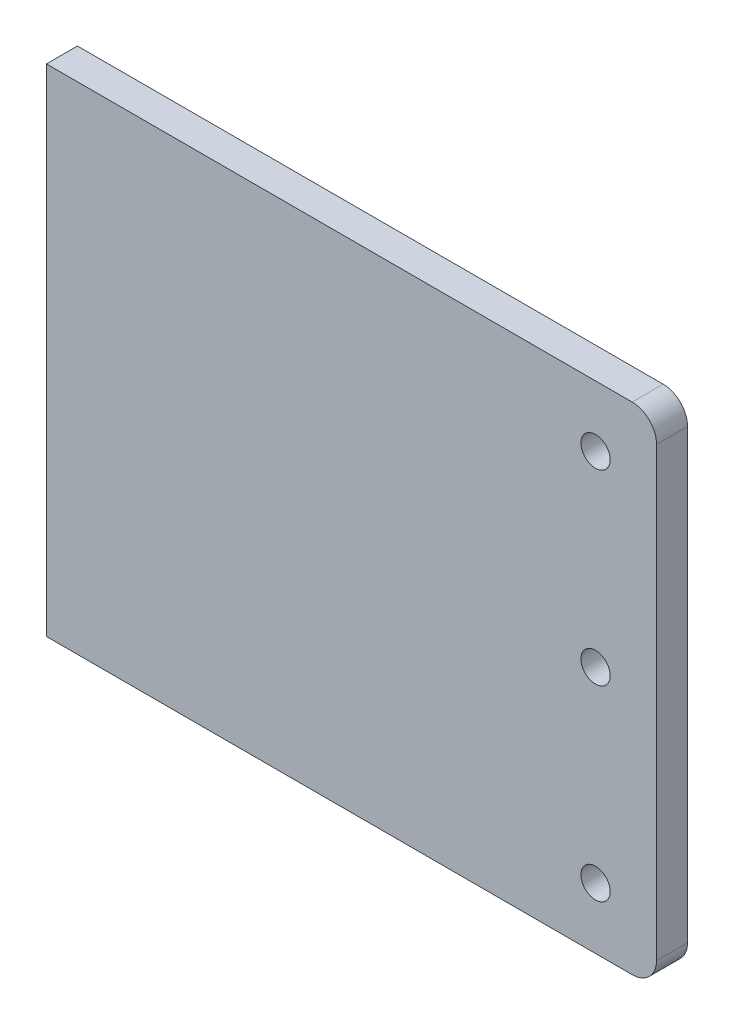
ISO-10303-21;
HEADER;
FILE_DESCRIPTION(('STEP AP214'),'2;1');
FILE_NAME('part.step','',(''),(''),'','','');
FILE_SCHEMA(('AUTOMOTIVE_DESIGN { 1 0 10303 214 1 1 1 1 }'));
ENDSEC;
DATA;
#1=APPLICATION_CONTEXT('core data for automotive mechanical design processes');
#2=APPLICATION_PROTOCOL_DEFINITION('international standard','automotive_design',2000,#1);
#3=PRODUCT_CONTEXT('',#1,'mechanical');
#4=PRODUCT('Part','Part','',(#3));
#5=PRODUCT_RELATED_PRODUCT_CATEGORY('part','',(#4));
#6=PRODUCT_DEFINITION_FORMATION('','',#4);
#7=PRODUCT_DEFINITION_CONTEXT('part definition',#1,'design');
#8=PRODUCT_DEFINITION('design','',#6,#7);
#9=PRODUCT_DEFINITION_SHAPE('','',#8);
#10=(LENGTH_UNIT() NAMED_UNIT(*) SI_UNIT(.MILLI.,.METRE.));
#11=(NAMED_UNIT(*) PLANE_ANGLE_UNIT() SI_UNIT($,.RADIAN.));
#12=(NAMED_UNIT(*) SI_UNIT($,.STERADIAN.) SOLID_ANGLE_UNIT());
#13=UNCERTAINTY_MEASURE_WITH_UNIT(LENGTH_MEASURE(1.E-05),#10,'distance_accuracy_value','');
#14=(GEOMETRIC_REPRESENTATION_CONTEXT(3) GLOBAL_UNCERTAINTY_ASSIGNED_CONTEXT((#13)) GLOBAL_UNIT_ASSIGNED_CONTEXT((#10,
#11,#12)) REPRESENTATION_CONTEXT('',''));
#15=CARTESIAN_POINT('',(0.,0.,0.));
#16=DIRECTION('',(0.,0.,1.));
#17=DIRECTION('',(1.,0.,0.));
#18=AXIS2_PLACEMENT_3D('',#15,#16,#17);
#19=CARTESIAN_POINT('',(-50.01,203.6,-127.004202423773));
#20=DIRECTION('',(0.,0.,-1.));
#21=DIRECTION('',(-1.,0.,0.));
#22=AXIS2_PLACEMENT_3D('',#19,#20,#21);
#23=PLANE('',#22);
#24=DIRECTION('',(1.,0.,0.));
#25=VECTOR('',#24,1.);
#26=CARTESIAN_POINT('',(-50.01,102.,-127.004202423773));
#27=LINE('',#26,#25);
#28=CARTESIAN_POINT('',(-50.,102.,-127.004202423773));
#29=VERTEX_POINT('',#28);
#30=CARTESIAN_POINT('',(70.,102.,-127.004202423773));
#31=VERTEX_POINT('',#30);
#32=EDGE_CURVE('E11',#29,#31,#27,.T.);
#33=ORIENTED_EDGE('',*,*,#32,.F.);
#34=DIRECTION('',(0.,-1.,0.));
#35=VECTOR('',#34,1.);
#36=CARTESIAN_POINT('',(-50.,0.,-127.004202423773));
#37=LINE('',#36,#35);
#38=CARTESIAN_POINT('',(-50.,203.6,-127.004202423773));
#39=VERTEX_POINT('',#38);
#40=EDGE_CURVE('E40',#39,#29,#37,.T.);
#41=ORIENTED_EDGE('',*,*,#40,.F.);
#42=DIRECTION('',(-1.,0.,0.));
#43=VECTOR('',#42,1.);
#44=CARTESIAN_POINT('',(50.,203.6,-127.004202423773));
#45=LINE('',#44,#43);
#46=CARTESIAN_POINT('',(70.,203.6,-127.004202423773));
#47=VERTEX_POINT('',#46);
#48=EDGE_CURVE('E95',#47,#39,#45,.T.);
#49=ORIENTED_EDGE('',*,*,#48,.F.);
#50=CARTESIAN_POINT('',(70.,198.6,-127.004202423773));
#51=DIRECTION('',(0.,0.,1.));
#52=DIRECTION('',(0.,-1.,0.));
#53=AXIS2_PLACEMENT_3D('',#50,#51,#52);
#54=CIRCLE('',#53,5.);
#55=CARTESIAN_POINT('',(75.,198.6,-127.004202423773));
#56=VERTEX_POINT('',#55);
#57=EDGE_CURVE('E131',#47,#56,#54,.F.);
#58=ORIENTED_EDGE('',*,*,#57,.T.);
#59=DIRECTION('',(0.,1.,0.));
#60=VECTOR('',#59,1.);
#61=CARTESIAN_POINT('',(75.,203.6,-127.004202423773));
#62=LINE('',#61,#60);
#63=CARTESIAN_POINT('',(75.,107.,-127.004202423773));
#64=VERTEX_POINT('',#63);
#65=EDGE_CURVE('E96',#64,#56,#62,.T.);
#66=ORIENTED_EDGE('',*,*,#65,.F.);
#67=CARTESIAN_POINT('',(70.,107.,-127.004202423773));
#68=DIRECTION('',(0.,0.,1.));
#69=DIRECTION('',(0.,-1.,0.));
#70=AXIS2_PLACEMENT_3D('',#67,#68,#69);
#71=CIRCLE('',#70,5.);
#72=EDGE_CURVE('E128',#64,#31,#71,.F.);
#73=ORIENTED_EDGE('',*,*,#72,.T.);
#74=EDGE_LOOP('',(#33,#41,#49,#58,#66,#73));
#75=FACE_BOUND('',#74,.T.);
#76=CARTESIAN_POINT('',(62.5,114.5,-127.004202423773));
#77=DIRECTION('',(0.,0.,1.));
#78=DIRECTION('',(0.,-1.,0.));
#79=AXIS2_PLACEMENT_3D('',#76,#77,#78);
#80=CIRCLE('',#79,3.00000000000001);
#81=CARTESIAN_POINT('',(62.5,111.5,-127.004202423773));
#82=VERTEX_POINT('',#81);
#83=EDGE_CURVE('E111',#82,#82,#80,.T.);
#84=ORIENTED_EDGE('',*,*,#83,.T.);
#85=EDGE_LOOP('',(#84));
#86=FACE_BOUND('',#85,.T.);
#87=CARTESIAN_POINT('',(62.5,191.1,-127.004202423773));
#88=DIRECTION('',(0.,0.,1.));
#89=DIRECTION('',(0.,-1.,0.));
#90=AXIS2_PLACEMENT_3D('',#87,#88,#89);
#91=CIRCLE('',#90,3.00000000000001);
#92=CARTESIAN_POINT('',(62.5,188.1,-127.004202423773));
#93=VERTEX_POINT('',#92);
#94=EDGE_CURVE('E116',#93,#93,#91,.T.);
#95=ORIENTED_EDGE('',*,*,#94,.T.);
#96=EDGE_LOOP('',(#95));
#97=FACE_BOUND('',#96,.T.);
#98=CARTESIAN_POINT('',(62.5,152.8,-127.004202423773));
#99=DIRECTION('',(0.,0.,1.));
#100=DIRECTION('',(0.,-1.,0.));
#101=AXIS2_PLACEMENT_3D('',#98,#99,#100);
#102=CIRCLE('',#101,3.00000000000001);
#103=CARTESIAN_POINT('',(62.5,149.8,-127.004202423773));
#104=VERTEX_POINT('',#103);
#105=EDGE_CURVE('E108',#104,#104,#102,.T.);
#106=ORIENTED_EDGE('',*,*,#105,.T.);
#107=EDGE_LOOP('',(#106));
#108=FACE_BOUND('',#107,.T.);
#109=ADVANCED_FACE('F36',(#75,#86,#97,#108),#23,.T.);
#110=CARTESIAN_POINT('',(-50.01,102.,-38.1042024237733));
#111=DIRECTION('',(0.,-1.,0.));
#112=DIRECTION('',(0.,0.,-1.));
#113=AXIS2_PLACEMENT_3D('',#110,#111,#112);
#114=PLANE('',#113);
#115=DIRECTION('',(0.,0.,1.));
#116=VECTOR('',#115,1.);
#117=CARTESIAN_POINT('',(-50.,102.,0.));
#118=LINE('',#117,#116);
#119=CARTESIAN_POINT('',(-50.,102.,-120.654202423773));
#120=VERTEX_POINT('',#119);
#121=EDGE_CURVE('E93',#29,#120,#118,.T.);
#122=ORIENTED_EDGE('',*,*,#121,.F.);
#123=ORIENTED_EDGE('',*,*,#32,.T.);
#124=DIRECTION('',(0.,0.,-1.));
#125=VECTOR('',#124,1.);
#126=CARTESIAN_POINT('',(70.,102.,-120.654202423773));
#127=LINE('',#126,#125);
#128=CARTESIAN_POINT('',(70.,102.,-120.654202423773));
#129=VERTEX_POINT('',#128);
#130=EDGE_CURVE('E60',#31,#129,#127,.F.);
#131=ORIENTED_EDGE('',*,*,#130,.T.);
#132=DIRECTION('',(-1.,0.,0.));
#133=VECTOR('',#132,1.);
#134=CARTESIAN_POINT('',(75.,102.,-120.654202423773));
#135=LINE('',#134,#133);
#136=EDGE_CURVE('E89',#129,#120,#135,.T.);
#137=ORIENTED_EDGE('',*,*,#136,.T.);
#138=EDGE_LOOP('',(#122,#123,#131,#137));
#139=FACE_BOUND('',#138,.T.);
#140=ADVANCED_FACE('F91',(#139),#114,.T.);
#141=CARTESIAN_POINT('',(-50.,0.,0.));
#142=DIRECTION('',(-1.,0.,0.));
#143=DIRECTION('',(0.,0.,1.));
#144=AXIS2_PLACEMENT_3D('',#141,#142,#143);
#145=PLANE('',#144);
#146=ORIENTED_EDGE('',*,*,#40,.T.);
#147=ORIENTED_EDGE('',*,*,#121,.T.);
#148=DIRECTION('',(0.,-1.,0.));
#149=VECTOR('',#148,1.);
#150=CARTESIAN_POINT('',(-50.,102.,-120.654202423773));
#151=LINE('',#150,#149);
#152=CARTESIAN_POINT('',(-50.,203.6,-120.654202423773));
#153=VERTEX_POINT('',#152);
#154=EDGE_CURVE('E99',#153,#120,#151,.T.);
#155=ORIENTED_EDGE('',*,*,#154,.F.);
#156=DIRECTION('',(0.,0.,1.));
#157=VECTOR('',#156,1.);
#158=CARTESIAN_POINT('',(-50.,203.6,-120.654202423773));
#159=LINE('',#158,#157);
#160=EDGE_CURVE('E104',#39,#153,#159,.T.);
#161=ORIENTED_EDGE('',*,*,#160,.F.);
#162=EDGE_LOOP('',(#146,#147,#155,#161));
#163=FACE_BOUND('',#162,.T.);
#164=ADVANCED_FACE('F38',(#163),#145,.T.);
#165=CARTESIAN_POINT('',(75.,0.,0.));
#166=DIRECTION('',(1.,0.,0.));
#167=DIRECTION('',(0.,0.,-1.));
#168=AXIS2_PLACEMENT_3D('',#165,#166,#167);
#169=PLANE('',#168);
#170=DIRECTION('',(0.,-1.,0.));
#171=VECTOR('',#170,1.);
#172=CARTESIAN_POINT('',(75.,203.6,-120.654202423773));
#173=LINE('',#172,#171);
#174=CARTESIAN_POINT('',(75.,198.6,-120.654202423773));
#175=VERTEX_POINT('',#174);
#176=CARTESIAN_POINT('',(75.,107.,-120.654202423773));
#177=VERTEX_POINT('',#176);
#178=EDGE_CURVE('E143',#175,#177,#173,.T.);
#179=ORIENTED_EDGE('',*,*,#178,.T.);
#180=DIRECTION('',(0.,0.,-1.));
#181=VECTOR('',#180,1.);
#182=CARTESIAN_POINT('',(75.,107.,-127.004202423773));
#183=LINE('',#182,#181);
#184=EDGE_CURVE('E133',#177,#64,#183,.T.);
#185=ORIENTED_EDGE('',*,*,#184,.T.);
#186=ORIENTED_EDGE('',*,*,#65,.T.);
#187=DIRECTION('',(0.,0.,1.));
#188=VECTOR('',#187,1.);
#189=CARTESIAN_POINT('',(75.,198.6,-120.654202423773));
#190=LINE('',#189,#188);
#191=EDGE_CURVE('E136',#56,#175,#190,.T.);
#192=ORIENTED_EDGE('',*,*,#191,.T.);
#193=EDGE_LOOP('',(#179,#185,#186,#192));
#194=FACE_BOUND('',#193,.T.);
#195=ADVANCED_FACE('F174',(#194),#169,.T.);
#196=CARTESIAN_POINT('',(50.,102.,-120.654202423773));
#197=DIRECTION('',(0.,0.,-1.));
#198=DIRECTION('',(-1.,0.,0.));
#199=AXIS2_PLACEMENT_3D('',#196,#197,#198);
#200=PLANE('',#199);
#201=CARTESIAN_POINT('',(62.5,114.5,-120.654202423773));
#202=DIRECTION('',(0.,0.,-1.));
#203=DIRECTION('',(-1.,0.,0.));
#204=AXIS2_PLACEMENT_3D('',#201,#202,#203);
#205=CIRCLE('',#204,3.00000000000001);
#206=CARTESIAN_POINT('',(59.5,114.5,-120.654202423773));
#207=VERTEX_POINT('',#206);
#208=EDGE_CURVE('E114',#207,#207,#205,.T.);
#209=ORIENTED_EDGE('',*,*,#208,.T.);
#210=EDGE_LOOP('',(#209));
#211=FACE_BOUND('',#210,.T.);
#212=CARTESIAN_POINT('',(62.5,191.1,-120.654202423773));
#213=DIRECTION('',(0.,0.,-1.));
#214=DIRECTION('',(-1.,0.,0.));
#215=AXIS2_PLACEMENT_3D('',#212,#213,#214);
#216=CIRCLE('',#215,3.00000000000001);
#217=CARTESIAN_POINT('',(59.5,191.1,-120.654202423773));
#218=VERTEX_POINT('',#217);
#219=EDGE_CURVE('E115',#218,#218,#216,.T.);
#220=ORIENTED_EDGE('',*,*,#219,.T.);
#221=EDGE_LOOP('',(#220));
#222=FACE_BOUND('',#221,.T.);
#223=CARTESIAN_POINT('',(62.5,152.8,-120.654202423773));
#224=DIRECTION('',(0.,0.,-1.));
#225=DIRECTION('',(-1.,0.,0.));
#226=AXIS2_PLACEMENT_3D('',#223,#224,#225);
#227=CIRCLE('',#226,3.00000000000001);
#228=CARTESIAN_POINT('',(59.5,152.8,-120.654202423773));
#229=VERTEX_POINT('',#228);
#230=EDGE_CURVE('E119',#229,#229,#227,.T.);
#231=ORIENTED_EDGE('',*,*,#230,.T.);
#232=EDGE_LOOP('',(#231));
#233=FACE_BOUND('',#232,.T.);
#234=ORIENTED_EDGE('',*,*,#136,.F.);
#235=CARTESIAN_POINT('',(70.,107.,-120.654202423773));
#236=DIRECTION('',(0.,0.,-1.));
#237=DIRECTION('',(-1.,0.,0.));
#238=AXIS2_PLACEMENT_3D('',#235,#236,#237);
#239=CIRCLE('',#238,5.);
#240=EDGE_CURVE('E124',#129,#177,#239,.F.);
#241=ORIENTED_EDGE('',*,*,#240,.T.);
#242=ORIENTED_EDGE('',*,*,#178,.F.);
#243=CARTESIAN_POINT('',(70.,198.6,-120.654202423773));
#244=DIRECTION('',(0.,0.,-1.));
#245=DIRECTION('',(-1.,0.,0.));
#246=AXIS2_PLACEMENT_3D('',#243,#244,#245);
#247=CIRCLE('',#246,5.);
#248=CARTESIAN_POINT('',(70.,203.6,-120.654202423773));
#249=VERTEX_POINT('',#248);
#250=EDGE_CURVE('E53',#175,#249,#247,.F.);
#251=ORIENTED_EDGE('',*,*,#250,.T.);
#252=DIRECTION('',(-1.,0.,0.));
#253=VECTOR('',#252,1.);
#254=CARTESIAN_POINT('',(50.,203.6,-120.654202423773));
#255=LINE('',#254,#253);
#256=EDGE_CURVE('E101',#249,#153,#255,.T.);
#257=ORIENTED_EDGE('',*,*,#256,.T.);
#258=ORIENTED_EDGE('',*,*,#154,.T.);
#259=EDGE_LOOP('',(#234,#241,#242,#251,#257,#258));
#260=FACE_BOUND('',#259,.T.);
#261=ADVANCED_FACE('F100',(#211,#222,#233,#260),#200,.F.);
#262=CARTESIAN_POINT('',(62.5,114.5,-143.154202423773));
#263=DIRECTION('',(0.,0.,1.));
#264=DIRECTION('',(1.,0.,0.));
#265=AXIS2_PLACEMENT_3D('',#262,#263,#264);
#266=CYLINDRICAL_SURFACE('',#265,3.00000000000001);
#267=ORIENTED_EDGE('',*,*,#83,.F.);
#268=EDGE_LOOP('',(#267));
#269=FACE_BOUND('',#268,.T.);
#270=ORIENTED_EDGE('',*,*,#208,.F.);
#271=EDGE_LOOP('',(#270));
#272=FACE_BOUND('',#271,.T.);
#273=ADVANCED_FACE('F168',(#269,#272),#266,.F.);
#274=CARTESIAN_POINT('',(62.5,191.1,-143.154202423773));
#275=DIRECTION('',(0.,0.,1.));
#276=DIRECTION('',(1.,0.,0.));
#277=AXIS2_PLACEMENT_3D('',#274,#275,#276);
#278=CYLINDRICAL_SURFACE('',#277,3.00000000000001);
#279=ORIENTED_EDGE('',*,*,#94,.F.);
#280=EDGE_LOOP('',(#279));
#281=FACE_BOUND('',#280,.T.);
#282=ORIENTED_EDGE('',*,*,#219,.F.);
#283=EDGE_LOOP('',(#282));
#284=FACE_BOUND('',#283,.T.);
#285=ADVANCED_FACE('F157',(#281,#284),#278,.F.);
#286=CARTESIAN_POINT('',(62.5,152.8,-143.154202423773));
#287=DIRECTION('',(0.,0.,1.));
#288=DIRECTION('',(1.,0.,0.));
#289=AXIS2_PLACEMENT_3D('',#286,#287,#288);
#290=CYLINDRICAL_SURFACE('',#289,3.00000000000001);
#291=ORIENTED_EDGE('',*,*,#105,.F.);
#292=EDGE_LOOP('',(#291));
#293=FACE_BOUND('',#292,.T.);
#294=ORIENTED_EDGE('',*,*,#230,.F.);
#295=EDGE_LOOP('',(#294));
#296=FACE_BOUND('',#295,.T.);
#297=ADVANCED_FACE('F154',(#293,#296),#290,.F.);
#298=CARTESIAN_POINT('',(70.,198.6,0.));
#299=DIRECTION('',(0.,0.,-1.));
#300=DIRECTION('',(-1.,0.,0.));
#301=AXIS2_PLACEMENT_3D('',#298,#299,#300);
#302=CYLINDRICAL_SURFACE('',#301,5.);
#303=ORIENTED_EDGE('',*,*,#57,.F.);
#304=DIRECTION('',(0.,0.,1.));
#305=VECTOR('',#304,1.);
#306=CARTESIAN_POINT('',(70.,203.6,-127.004202423773));
#307=LINE('',#306,#305);
#308=EDGE_CURVE('E45',#249,#47,#307,.F.);
#309=ORIENTED_EDGE('',*,*,#308,.F.);
#310=ORIENTED_EDGE('',*,*,#250,.F.);
#311=ORIENTED_EDGE('',*,*,#191,.F.);
#312=EDGE_LOOP('',(#303,#309,#310,#311));
#313=FACE_BOUND('',#312,.T.);
#314=ADVANCED_FACE('F156',(#313),#302,.T.);
#315=CARTESIAN_POINT('',(70.,107.,-2.33846188257661E-13));
#316=DIRECTION('',(0.,0.,1.));
#317=DIRECTION('',(0.,-1.,0.));
#318=AXIS2_PLACEMENT_3D('',#315,#316,#317);
#319=CYLINDRICAL_SURFACE('',#318,5.);
#320=ORIENTED_EDGE('',*,*,#240,.F.);
#321=ORIENTED_EDGE('',*,*,#130,.F.);
#322=ORIENTED_EDGE('',*,*,#72,.F.);
#323=ORIENTED_EDGE('',*,*,#184,.F.);
#324=EDGE_LOOP('',(#320,#321,#322,#323));
#325=FACE_BOUND('',#324,.T.);
#326=ADVANCED_FACE('F165',(#325),#319,.T.);
#327=CARTESIAN_POINT('',(50.,203.6,-120.654202423773));
#328=DIRECTION('',(0.,-1.,0.));
#329=DIRECTION('',(0.,0.,-1.));
#330=AXIS2_PLACEMENT_3D('',#327,#328,#329);
#331=PLANE('',#330);
#332=ORIENTED_EDGE('',*,*,#48,.T.);
#333=ORIENTED_EDGE('',*,*,#160,.T.);
#334=ORIENTED_EDGE('',*,*,#256,.F.);
#335=ORIENTED_EDGE('',*,*,#308,.T.);
#336=EDGE_LOOP('',(#332,#333,#334,#335));
#337=FACE_BOUND('',#336,.T.);
#338=ADVANCED_FACE('F188',(#337),#331,.F.);
#339=CLOSED_SHELL('',(#109,#140,#164,#195,#261,#273,#285,#297,#314,#326,#338));
#340=MANIFOLD_SOLID_BREP('B2',#339);
#341=ADVANCED_BREP_SHAPE_REPRESENTATION('',(#18,#340),#14);
#342=SHAPE_DEFINITION_REPRESENTATION(#9,#341);
ENDSEC;
END-ISO-10303-21;
